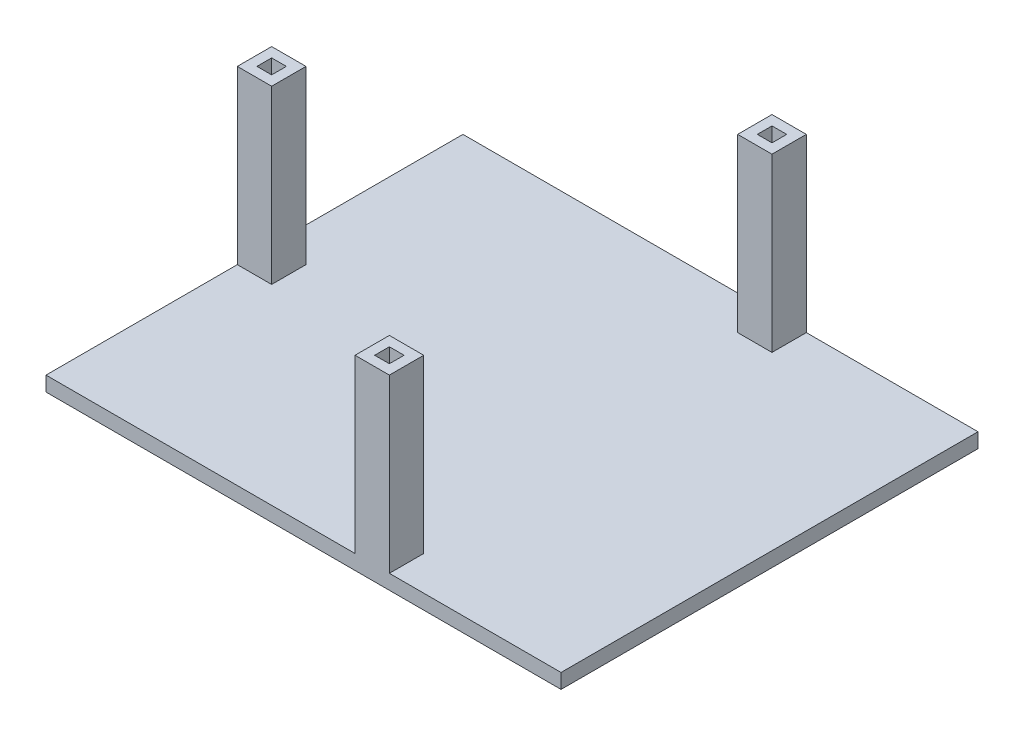
ISO-10303-21;
HEADER;
FILE_DESCRIPTION(('STEP AP214'),'2;1');
FILE_NAME('part.step','',(''),(''),'','','');
FILE_SCHEMA(('AUTOMOTIVE_DESIGN { 1 0 10303 214 1 1 1 1 }'));
ENDSEC;
DATA;
#1=APPLICATION_CONTEXT('core data for automotive mechanical design processes');
#2=APPLICATION_PROTOCOL_DEFINITION('international standard','automotive_design',2000,#1);
#3=PRODUCT_CONTEXT('',#1,'mechanical');
#4=PRODUCT('Part','Part','',(#3));
#5=PRODUCT_RELATED_PRODUCT_CATEGORY('part','',(#4));
#6=PRODUCT_DEFINITION_FORMATION('','',#4);
#7=PRODUCT_DEFINITION_CONTEXT('part definition',#1,'design');
#8=PRODUCT_DEFINITION('design','',#6,#7);
#9=PRODUCT_DEFINITION_SHAPE('','',#8);
#10=(LENGTH_UNIT() NAMED_UNIT(*) SI_UNIT(.MILLI.,.METRE.));
#11=(NAMED_UNIT(*) PLANE_ANGLE_UNIT() SI_UNIT($,.RADIAN.));
#12=(NAMED_UNIT(*) SI_UNIT($,.STERADIAN.) SOLID_ANGLE_UNIT());
#13=UNCERTAINTY_MEASURE_WITH_UNIT(LENGTH_MEASURE(1.E-05),#10,'distance_accuracy_value','');
#14=(GEOMETRIC_REPRESENTATION_CONTEXT(3) GLOBAL_UNCERTAINTY_ASSIGNED_CONTEXT((#13)) GLOBAL_UNIT_ASSIGNED_CONTEXT((#10,
#11,#12)) REPRESENTATION_CONTEXT('',''));
#15=CARTESIAN_POINT('',(0.,0.,0.));
#16=DIRECTION('',(0.,0.,1.));
#17=DIRECTION('',(1.,0.,0.));
#18=AXIS2_PLACEMENT_3D('',#15,#16,#17);
#19=CARTESIAN_POINT('',(0.,3.,0.));
#20=DIRECTION('',(0.,-1.,0.));
#21=DIRECTION('',(0.,0.,-1.));
#22=AXIS2_PLACEMENT_3D('',#19,#20,#21);
#23=PLANE('',#22);
#24=DIRECTION('',(0.,0.,1.));
#25=VECTOR('',#24,1.);
#26=CARTESIAN_POINT('',(-47.8168846611177,3.,0.));
#27=LINE('',#26,#25);
#28=CARTESIAN_POINT('',(-47.8168846611177,3.,19.3988109393579));
#29=VERTEX_POINT('',#28);
#30=CARTESIAN_POINT('',(-47.8168846611177,3.,26.3988109393579));
#31=VERTEX_POINT('',#30);
#32=EDGE_CURVE('E261',#29,#31,#27,.T.);
#33=ORIENTED_EDGE('',*,*,#32,.T.);
#34=DIRECTION('',(-1.,0.,0.));
#35=VECTOR('',#34,1.);
#36=CARTESIAN_POINT('',(0.,3.,26.3988109393579));
#37=LINE('',#36,#35);
#38=CARTESIAN_POINT('',(-54.8168846611177,3.,26.3988109393579));
#39=VERTEX_POINT('',#38);
#40=EDGE_CURVE('E224',#31,#39,#37,.T.);
#41=ORIENTED_EDGE('',*,*,#40,.T.);
#42=DIRECTION('',(0.,0.,-1.));
#43=VECTOR('',#42,1.);
#44=CARTESIAN_POINT('',(-54.8168846611177,3.,65.3988109393579));
#45=LINE('',#44,#43);
#46=CARTESIAN_POINT('',(-54.8168846611177,3.,65.3988109393579));
#47=VERTEX_POINT('',#46);
#48=EDGE_CURVE('E418',#47,#39,#45,.T.);
#49=ORIENTED_EDGE('',*,*,#48,.F.);
#50=DIRECTION('',(-1.,0.,0.));
#51=VECTOR('',#50,1.);
#52=CARTESIAN_POINT('',(50.1831153388823,3.,65.3988109393579));
#53=LINE('',#52,#51);
#54=CARTESIAN_POINT('',(8.18311533888228,3.,65.3988109393579));
#55=VERTEX_POINT('',#54);
#56=EDGE_CURVE('E417',#55,#47,#53,.T.);
#57=ORIENTED_EDGE('',*,*,#56,.F.);
#58=DIRECTION('',(0.,0.,1.));
#59=VECTOR('',#58,1.);
#60=CARTESIAN_POINT('',(8.18311533888228,3.,0.));
#61=LINE('',#60,#59);
#62=CARTESIAN_POINT('',(8.18311533888228,3.,58.3988109393579));
#63=VERTEX_POINT('',#62);
#64=EDGE_CURVE('E387',#63,#55,#61,.T.);
#65=ORIENTED_EDGE('',*,*,#64,.F.);
#66=DIRECTION('',(-1.,0.,0.));
#67=VECTOR('',#66,1.);
#68=CARTESIAN_POINT('',(0.,3.,58.3988109393579));
#69=LINE('',#68,#67);
#70=CARTESIAN_POINT('',(15.1831153388823,3.,58.3988109393579));
#71=VERTEX_POINT('',#70);
#72=EDGE_CURVE('E384',#71,#63,#69,.T.);
#73=ORIENTED_EDGE('',*,*,#72,.F.);
#74=DIRECTION('',(0.,0.,-1.));
#75=VECTOR('',#74,1.);
#76=CARTESIAN_POINT('',(15.1831153388823,3.,0.));
#77=LINE('',#76,#75);
#78=CARTESIAN_POINT('',(15.1831153388823,3.,65.3988109393579));
#79=VERTEX_POINT('',#78);
#80=EDGE_CURVE('E355',#79,#71,#77,.T.);
#81=ORIENTED_EDGE('',*,*,#80,.F.);
#82=CARTESIAN_POINT('',(50.1831153388823,3.,65.3988109393579));
#83=VERTEX_POINT('',#82);
#84=EDGE_CURVE('E413',#83,#79,#53,.T.);
#85=ORIENTED_EDGE('',*,*,#84,.F.);
#86=DIRECTION('',(0.,0.,1.));
#87=VECTOR('',#86,1.);
#88=CARTESIAN_POINT('',(50.1831153388823,3.,-19.6011890606421));
#89=LINE('',#88,#87);
#90=CARTESIAN_POINT('',(50.1831153388823,3.,-19.6011890606421));
#91=VERTEX_POINT('',#90);
#92=EDGE_CURVE('E425',#91,#83,#89,.T.);
#93=ORIENTED_EDGE('',*,*,#92,.F.);
#94=DIRECTION('',(1.,0.,0.));
#95=VECTOR('',#94,1.);
#96=CARTESIAN_POINT('',(-54.8168846611177,3.,-19.6011890606421));
#97=LINE('',#96,#95);
#98=CARTESIAN_POINT('',(15.1831153388823,3.,-19.6011890606421));
#99=VERTEX_POINT('',#98);
#100=EDGE_CURVE('E421',#99,#91,#97,.T.);
#101=ORIENTED_EDGE('',*,*,#100,.F.);
#102=DIRECTION('',(0.,0.,1.));
#103=VECTOR('',#102,1.);
#104=CARTESIAN_POINT('',(15.1831153388823,3.,0.));
#105=LINE('',#104,#103);
#106=CARTESIAN_POINT('',(15.1831153388823,3.,-12.6011890606421));
#107=VERTEX_POINT('',#106);
#108=EDGE_CURVE('E317',#99,#107,#105,.T.);
#109=ORIENTED_EDGE('',*,*,#108,.T.);
#110=DIRECTION('',(-1.,0.,0.));
#111=VECTOR('',#110,1.);
#112=CARTESIAN_POINT('',(0.,3.,-12.6011890606421));
#113=LINE('',#112,#111);
#114=CARTESIAN_POINT('',(8.18311533888227,3.,-12.6011890606421));
#115=VERTEX_POINT('',#114);
#116=EDGE_CURVE('E314',#107,#115,#113,.T.);
#117=ORIENTED_EDGE('',*,*,#116,.T.);
#118=DIRECTION('',(0.,0.,-1.));
#119=VECTOR('',#118,1.);
#120=CARTESIAN_POINT('',(8.18311533888226,3.,0.));
#121=LINE('',#120,#119);
#122=CARTESIAN_POINT('',(8.18311533888227,3.,-19.6011890606421));
#123=VERTEX_POINT('',#122);
#124=EDGE_CURVE('E283',#115,#123,#121,.T.);
#125=ORIENTED_EDGE('',*,*,#124,.T.);
#126=CARTESIAN_POINT('',(-54.8168846611177,3.,-19.6011890606421));
#127=VERTEX_POINT('',#126);
#128=EDGE_CURVE('E422',#127,#123,#97,.T.);
#129=ORIENTED_EDGE('',*,*,#128,.F.);
#130=CARTESIAN_POINT('',(-54.8168846611177,3.,19.3988109393579));
#131=VERTEX_POINT('',#130);
#132=EDGE_CURVE('E416',#131,#127,#45,.T.);
#133=ORIENTED_EDGE('',*,*,#132,.F.);
#134=DIRECTION('',(1.,0.,0.));
#135=VECTOR('',#134,1.);
#136=CARTESIAN_POINT('',(0.,3.,19.3988109393579));
#137=LINE('',#136,#135);
#138=EDGE_CURVE('E263',#131,#29,#137,.T.);
#139=ORIENTED_EDGE('',*,*,#138,.T.);
#140=EDGE_LOOP('',(#33,#41,#49,#57,#65,#73,#81,#85,#93,#101,#109,#117,#125,#129,#133,#139));
#141=FACE_BOUND('',#140,.T.);
#142=ADVANCED_FACE('F35',(#141),#23,.F.);
#143=CARTESIAN_POINT('',(50.1831153388823,3.,65.3988109393579));
#144=DIRECTION('',(0.,0.,1.));
#145=DIRECTION('',(1.,0.,0.));
#146=AXIS2_PLACEMENT_3D('',#143,#144,#145);
#147=PLANE('',#146);
#148=DIRECTION('',(-1.,0.,0.));
#149=VECTOR('',#148,1.);
#150=CARTESIAN_POINT('',(50.1831153388823,0.,65.3988109393579));
#151=LINE('',#150,#149);
#152=CARTESIAN_POINT('',(50.1831153388823,0.,65.3988109393579));
#153=VERTEX_POINT('',#152);
#154=CARTESIAN_POINT('',(-54.8168846611177,0.,65.3988109393579));
#155=VERTEX_POINT('',#154);
#156=EDGE_CURVE('E405',#153,#155,#151,.T.);
#157=ORIENTED_EDGE('',*,*,#156,.F.);
#158=DIRECTION('',(0.,-1.,0.));
#159=VECTOR('',#158,1.);
#160=CARTESIAN_POINT('',(50.1831153388823,3.,65.3988109393579));
#161=LINE('',#160,#159);
#162=EDGE_CURVE('E11',#83,#153,#161,.T.);
#163=ORIENTED_EDGE('',*,*,#162,.F.);
#164=ORIENTED_EDGE('',*,*,#84,.T.);
#165=DIRECTION('',(0.,-1.,0.));
#166=VECTOR('',#165,1.);
#167=CARTESIAN_POINT('',(15.1831153388823,38.,65.3988109393579));
#168=LINE('',#167,#166);
#169=CARTESIAN_POINT('',(15.1831153388823,38.,65.3988109393579));
#170=VERTEX_POINT('',#169);
#171=EDGE_CURVE('E395',#170,#79,#168,.T.);
#172=ORIENTED_EDGE('',*,*,#171,.F.);
#173=DIRECTION('',(1.,0.,0.));
#174=VECTOR('',#173,1.);
#175=CARTESIAN_POINT('',(0.,38.,65.3988109393579));
#176=LINE('',#175,#174);
#177=CARTESIAN_POINT('',(8.18311533888228,38.,65.3988109393579));
#178=VERTEX_POINT('',#177);
#179=EDGE_CURVE('E368',#178,#170,#176,.T.);
#180=ORIENTED_EDGE('',*,*,#179,.F.);
#181=DIRECTION('',(0.,-1.,0.));
#182=VECTOR('',#181,1.);
#183=CARTESIAN_POINT('',(8.18311533888228,38.,65.3988109393579));
#184=LINE('',#183,#182);
#185=EDGE_CURVE('E399',#178,#55,#184,.T.);
#186=ORIENTED_EDGE('',*,*,#185,.T.);
#187=ORIENTED_EDGE('',*,*,#56,.T.);
#188=DIRECTION('',(0.,-1.,0.));
#189=VECTOR('',#188,1.);
#190=CARTESIAN_POINT('',(-54.8168846611177,3.,65.3988109393579));
#191=LINE('',#190,#189);
#192=EDGE_CURVE('E39',#47,#155,#191,.T.);
#193=ORIENTED_EDGE('',*,*,#192,.T.);
#194=EDGE_LOOP('',(#157,#163,#164,#172,#180,#186,#187,#193));
#195=FACE_BOUND('',#194,.T.);
#196=ADVANCED_FACE('F37',(#195),#147,.T.);
#197=CARTESIAN_POINT('',(50.1831153388823,3.,-19.6011890606421));
#198=DIRECTION('',(1.,0.,0.));
#199=DIRECTION('',(0.,0.,-1.));
#200=AXIS2_PLACEMENT_3D('',#197,#198,#199);
#201=PLANE('',#200);
#202=DIRECTION('',(0.,0.,1.));
#203=VECTOR('',#202,1.);
#204=CARTESIAN_POINT('',(50.1831153388823,0.,-19.6011890606421));
#205=LINE('',#204,#203);
#206=CARTESIAN_POINT('',(50.1831153388823,0.,-19.6011890606421));
#207=VERTEX_POINT('',#206);
#208=EDGE_CURVE('E436',#207,#153,#205,.T.);
#209=ORIENTED_EDGE('',*,*,#208,.F.);
#210=DIRECTION('',(0.,-1.,0.));
#211=VECTOR('',#210,1.);
#212=CARTESIAN_POINT('',(50.1831153388823,3.,-19.6011890606421));
#213=LINE('',#212,#211);
#214=EDGE_CURVE('E44',#91,#207,#213,.T.);
#215=ORIENTED_EDGE('',*,*,#214,.F.);
#216=ORIENTED_EDGE('',*,*,#92,.T.);
#217=ORIENTED_EDGE('',*,*,#162,.T.);
#218=EDGE_LOOP('',(#209,#215,#216,#217));
#219=FACE_BOUND('',#218,.T.);
#220=ADVANCED_FACE('F454',(#219),#201,.T.);
#221=CARTESIAN_POINT('',(-54.8168846611177,3.,-19.6011890606421));
#222=DIRECTION('',(0.,0.,-1.));
#223=DIRECTION('',(-1.,0.,0.));
#224=AXIS2_PLACEMENT_3D('',#221,#222,#223);
#225=PLANE('',#224);
#226=DIRECTION('',(1.,0.,0.));
#227=VECTOR('',#226,1.);
#228=CARTESIAN_POINT('',(-54.8168846611177,0.,-19.6011890606421));
#229=LINE('',#228,#227);
#230=CARTESIAN_POINT('',(-54.8168846611177,0.,-19.6011890606421));
#231=VERTEX_POINT('',#230);
#232=EDGE_CURVE('E433',#231,#207,#229,.T.);
#233=ORIENTED_EDGE('',*,*,#232,.F.);
#234=DIRECTION('',(0.,-1.,0.));
#235=VECTOR('',#234,1.);
#236=CARTESIAN_POINT('',(-54.8168846611177,3.,-19.6011890606421));
#237=LINE('',#236,#235);
#238=EDGE_CURVE('E439',#127,#231,#237,.T.);
#239=ORIENTED_EDGE('',*,*,#238,.F.);
#240=ORIENTED_EDGE('',*,*,#128,.T.);
#241=DIRECTION('',(0.,-1.,0.));
#242=VECTOR('',#241,1.);
#243=CARTESIAN_POINT('',(8.18311533888227,38.,-19.6011890606421));
#244=LINE('',#243,#242);
#245=CARTESIAN_POINT('',(8.18311533888227,38.,-19.6011890606421));
#246=VERTEX_POINT('',#245);
#247=EDGE_CURVE('E311',#246,#123,#244,.T.);
#248=ORIENTED_EDGE('',*,*,#247,.F.);
#249=DIRECTION('',(-1.,0.,0.));
#250=VECTOR('',#249,1.);
#251=CARTESIAN_POINT('',(0.,38.,-19.6011890606421));
#252=LINE('',#251,#250);
#253=CARTESIAN_POINT('',(15.1831153388823,38.,-19.6011890606421));
#254=VERTEX_POINT('',#253);
#255=EDGE_CURVE('E299',#254,#246,#252,.T.);
#256=ORIENTED_EDGE('',*,*,#255,.F.);
#257=DIRECTION('',(0.,-1.,0.));
#258=VECTOR('',#257,1.);
#259=CARTESIAN_POINT('',(15.1831153388823,38.,-19.6011890606421));
#260=LINE('',#259,#258);
#261=EDGE_CURVE('E345',#254,#99,#260,.T.);
#262=ORIENTED_EDGE('',*,*,#261,.T.);
#263=ORIENTED_EDGE('',*,*,#100,.T.);
#264=ORIENTED_EDGE('',*,*,#214,.T.);
#265=EDGE_LOOP('',(#233,#239,#240,#248,#256,#262,#263,#264));
#266=FACE_BOUND('',#265,.T.);
#267=ADVANCED_FACE('F479',(#266),#225,.T.);
#268=CARTESIAN_POINT('',(-54.8168846611177,3.,65.3988109393579));
#269=DIRECTION('',(-1.,0.,0.));
#270=DIRECTION('',(0.,0.,1.));
#271=AXIS2_PLACEMENT_3D('',#268,#269,#270);
#272=PLANE('',#271);
#273=DIRECTION('',(0.,0.,-1.));
#274=VECTOR('',#273,1.);
#275=CARTESIAN_POINT('',(-54.8168846611177,0.,65.3988109393579));
#276=LINE('',#275,#274);
#277=EDGE_CURVE('E430',#155,#231,#276,.T.);
#278=ORIENTED_EDGE('',*,*,#277,.F.);
#279=ORIENTED_EDGE('',*,*,#192,.F.);
#280=ORIENTED_EDGE('',*,*,#48,.T.);
#281=DIRECTION('',(0.,-1.,0.));
#282=VECTOR('',#281,1.);
#283=CARTESIAN_POINT('',(-54.8168846611177,38.,26.3988109393579));
#284=LINE('',#283,#282);
#285=CARTESIAN_POINT('',(-54.8168846611177,38.,26.3988109393579));
#286=VERTEX_POINT('',#285);
#287=EDGE_CURVE('E259',#286,#39,#284,.T.);
#288=ORIENTED_EDGE('',*,*,#287,.F.);
#289=DIRECTION('',(0.,0.,1.));
#290=VECTOR('',#289,1.);
#291=CARTESIAN_POINT('',(-54.8168846611177,38.,0.));
#292=LINE('',#291,#290);
#293=CARTESIAN_POINT('',(-54.8168846611177,38.,19.3988109393579));
#294=VERTEX_POINT('',#293);
#295=EDGE_CURVE('E240',#294,#286,#292,.T.);
#296=ORIENTED_EDGE('',*,*,#295,.F.);
#297=DIRECTION('',(0.,-1.,0.));
#298=VECTOR('',#297,1.);
#299=CARTESIAN_POINT('',(-54.8168846611177,38.,19.3988109393579));
#300=LINE('',#299,#298);
#301=EDGE_CURVE('E285',#294,#131,#300,.T.);
#302=ORIENTED_EDGE('',*,*,#301,.T.);
#303=ORIENTED_EDGE('',*,*,#132,.T.);
#304=ORIENTED_EDGE('',*,*,#238,.T.);
#305=EDGE_LOOP('',(#278,#279,#280,#288,#296,#302,#303,#304));
#306=FACE_BOUND('',#305,.T.);
#307=ADVANCED_FACE('F448',(#306),#272,.T.);
#308=CARTESIAN_POINT('',(0.,0.,0.));
#309=DIRECTION('',(0.,-1.,0.));
#310=DIRECTION('',(0.,0.,-1.));
#311=AXIS2_PLACEMENT_3D('',#308,#309,#310);
#312=PLANE('',#311);
#313=ORIENTED_EDGE('',*,*,#156,.T.);
#314=ORIENTED_EDGE('',*,*,#277,.T.);
#315=ORIENTED_EDGE('',*,*,#232,.T.);
#316=ORIENTED_EDGE('',*,*,#208,.T.);
#317=EDGE_LOOP('',(#313,#314,#315,#316));
#318=FACE_BOUND('',#317,.T.);
#319=ADVANCED_FACE('F450',(#318),#312,.T.);
#320=CARTESIAN_POINT('',(0.,38.,58.3988109393579));
#321=DIRECTION('',(0.,0.,1.));
#322=DIRECTION('',(1.,0.,0.));
#323=AXIS2_PLACEMENT_3D('',#320,#321,#322);
#324=PLANE('',#323);
#325=ORIENTED_EDGE('',*,*,#72,.T.);
#326=DIRECTION('',(0.,-1.,0.));
#327=VECTOR('',#326,1.);
#328=CARTESIAN_POINT('',(8.18311533888228,38.,58.3988109393579));
#329=LINE('',#328,#327);
#330=CARTESIAN_POINT('',(8.18311533888228,38.,58.3988109393579));
#331=VERTEX_POINT('',#330);
#332=EDGE_CURVE('E402',#331,#63,#329,.T.);
#333=ORIENTED_EDGE('',*,*,#332,.F.);
#334=DIRECTION('',(-1.,0.,0.));
#335=VECTOR('',#334,1.);
#336=CARTESIAN_POINT('',(0.,38.,58.3988109393579));
#337=LINE('',#336,#335);
#338=CARTESIAN_POINT('',(15.1831153388823,38.,58.3988109393579));
#339=VERTEX_POINT('',#338);
#340=EDGE_CURVE('E363',#339,#331,#337,.T.);
#341=ORIENTED_EDGE('',*,*,#340,.F.);
#342=DIRECTION('',(0.,-1.,0.));
#343=VECTOR('',#342,1.);
#344=CARTESIAN_POINT('',(15.1831153388823,38.,58.3988109393579));
#345=LINE('',#344,#343);
#346=EDGE_CURVE('E392',#339,#71,#345,.T.);
#347=ORIENTED_EDGE('',*,*,#346,.T.);
#348=EDGE_LOOP('',(#325,#333,#341,#347));
#349=FACE_BOUND('',#348,.T.);
#350=ADVANCED_FACE('F466',(#349),#324,.F.);
#351=CARTESIAN_POINT('',(8.18311533888228,38.,0.));
#352=DIRECTION('',(1.,0.,0.));
#353=DIRECTION('',(0.,0.,-1.));
#354=AXIS2_PLACEMENT_3D('',#351,#352,#353);
#355=PLANE('',#354);
#356=ORIENTED_EDGE('',*,*,#64,.T.);
#357=ORIENTED_EDGE('',*,*,#185,.F.);
#358=DIRECTION('',(0.,0.,1.));
#359=VECTOR('',#358,1.);
#360=CARTESIAN_POINT('',(8.18311533888228,38.,0.));
#361=LINE('',#360,#359);
#362=EDGE_CURVE('E366',#331,#178,#361,.T.);
#363=ORIENTED_EDGE('',*,*,#362,.F.);
#364=ORIENTED_EDGE('',*,*,#332,.T.);
#365=EDGE_LOOP('',(#356,#357,#363,#364));
#366=FACE_BOUND('',#365,.T.);
#367=ADVANCED_FACE('F473',(#366),#355,.F.);
#368=CARTESIAN_POINT('',(0.,38.,63.3988109393579));
#369=DIRECTION('',(0.,0.,-1.));
#370=DIRECTION('',(-1.,0.,0.));
#371=AXIS2_PLACEMENT_3D('',#368,#369,#370);
#372=PLANE('',#371);
#373=DIRECTION('',(1.,0.,0.));
#374=VECTOR('',#373,1.);
#375=CARTESIAN_POINT('',(0.,3.,63.3988109393579));
#376=LINE('',#375,#374);
#377=CARTESIAN_POINT('',(10.1831153388823,3.,63.3988109393579));
#378=VERTEX_POINT('',#377);
#379=CARTESIAN_POINT('',(13.1831153388823,3.,63.3988109393579));
#380=VERTEX_POINT('',#379);
#381=EDGE_CURVE('E343',#378,#380,#376,.T.);
#382=ORIENTED_EDGE('',*,*,#381,.F.);
#383=DIRECTION('',(0.,-1.,0.));
#384=VECTOR('',#383,1.);
#385=CARTESIAN_POINT('',(10.1831153388823,38.,63.3988109393579));
#386=LINE('',#385,#384);
#387=CARTESIAN_POINT('',(10.1831153388823,38.,63.3988109393579));
#388=VERTEX_POINT('',#387);
#389=EDGE_CURVE('E396',#388,#378,#386,.T.);
#390=ORIENTED_EDGE('',*,*,#389,.F.);
#391=DIRECTION('',(1.,0.,0.));
#392=VECTOR('',#391,1.);
#393=CARTESIAN_POINT('',(0.,38.,63.3988109393579));
#394=LINE('',#393,#392);
#395=CARTESIAN_POINT('',(13.1831153388823,38.,63.3988109393579));
#396=VERTEX_POINT('',#395);
#397=EDGE_CURVE('E351',#388,#396,#394,.T.);
#398=ORIENTED_EDGE('',*,*,#397,.T.);
#399=DIRECTION('',(0.,-1.,0.));
#400=VECTOR('',#399,1.);
#401=CARTESIAN_POINT('',(13.1831153388823,38.,63.3988109393579));
#402=LINE('',#401,#400);
#403=EDGE_CURVE('E372',#396,#380,#402,.T.);
#404=ORIENTED_EDGE('',*,*,#403,.T.);
#405=EDGE_LOOP('',(#382,#390,#398,#404));
#406=FACE_BOUND('',#405,.T.);
#407=ADVANCED_FACE('F552',(#406),#372,.T.);
#408=CARTESIAN_POINT('',(10.1831153388823,38.,0.));
#409=DIRECTION('',(1.,0.,0.));
#410=DIRECTION('',(0.,0.,-1.));
#411=AXIS2_PLACEMENT_3D('',#408,#409,#410);
#412=PLANE('',#411);
#413=DIRECTION('',(0.,0.,1.));
#414=VECTOR('',#413,1.);
#415=CARTESIAN_POINT('',(10.1831153388823,3.,0.));
#416=LINE('',#415,#414);
#417=CARTESIAN_POINT('',(10.1831153388823,3.,60.3988109393579));
#418=VERTEX_POINT('',#417);
#419=EDGE_CURVE('E375',#418,#378,#416,.T.);
#420=ORIENTED_EDGE('',*,*,#419,.F.);
#421=DIRECTION('',(0.,-1.,0.));
#422=VECTOR('',#421,1.);
#423=CARTESIAN_POINT('',(10.1831153388823,38.,60.3988109393579));
#424=LINE('',#423,#422);
#425=CARTESIAN_POINT('',(10.1831153388823,38.,60.3988109393579));
#426=VERTEX_POINT('',#425);
#427=EDGE_CURVE('E409',#426,#418,#424,.T.);
#428=ORIENTED_EDGE('',*,*,#427,.F.);
#429=DIRECTION('',(0.,0.,1.));
#430=VECTOR('',#429,1.);
#431=CARTESIAN_POINT('',(10.1831153388823,38.,0.));
#432=LINE('',#431,#430);
#433=EDGE_CURVE('E354',#426,#388,#432,.T.);
#434=ORIENTED_EDGE('',*,*,#433,.T.);
#435=ORIENTED_EDGE('',*,*,#389,.T.);
#436=EDGE_LOOP('',(#420,#428,#434,#435));
#437=FACE_BOUND('',#436,.T.);
#438=ADVANCED_FACE('F548',(#437),#412,.T.);
#439=CARTESIAN_POINT('',(0.,38.,60.3988109393579));
#440=DIRECTION('',(0.,0.,1.));
#441=DIRECTION('',(1.,0.,0.));
#442=AXIS2_PLACEMENT_3D('',#439,#440,#441);
#443=PLANE('',#442);
#444=DIRECTION('',(-1.,0.,0.));
#445=VECTOR('',#444,1.);
#446=CARTESIAN_POINT('',(0.,3.,60.3988109393579));
#447=LINE('',#446,#445);
#448=CARTESIAN_POINT('',(13.1831153388823,3.,60.3988109393579));
#449=VERTEX_POINT('',#448);
#450=EDGE_CURVE('E378',#449,#418,#447,.T.);
#451=ORIENTED_EDGE('',*,*,#450,.F.);
#452=DIRECTION('',(0.,-1.,0.));
#453=VECTOR('',#452,1.);
#454=CARTESIAN_POINT('',(13.1831153388823,38.,60.3988109393579));
#455=LINE('',#454,#453);
#456=CARTESIAN_POINT('',(13.1831153388823,38.,60.3988109393579));
#457=VERTEX_POINT('',#456);
#458=EDGE_CURVE('E407',#457,#449,#455,.T.);
#459=ORIENTED_EDGE('',*,*,#458,.F.);
#460=DIRECTION('',(-1.,0.,0.));
#461=VECTOR('',#460,1.);
#462=CARTESIAN_POINT('',(0.,38.,60.3988109393579));
#463=LINE('',#462,#461);
#464=EDGE_CURVE('E358',#457,#426,#463,.T.);
#465=ORIENTED_EDGE('',*,*,#464,.T.);
#466=ORIENTED_EDGE('',*,*,#427,.T.);
#467=EDGE_LOOP('',(#451,#459,#465,#466));
#468=FACE_BOUND('',#467,.T.);
#469=ADVANCED_FACE('F559',(#468),#443,.T.);
#470=CARTESIAN_POINT('',(13.1831153388823,38.,0.));
#471=DIRECTION('',(1.,0.,0.));
#472=DIRECTION('',(0.,0.,-1.));
#473=AXIS2_PLACEMENT_3D('',#470,#471,#472);
#474=PLANE('',#473);
#475=DIRECTION('',(0.,0.,1.));
#476=VECTOR('',#475,1.);
#477=CARTESIAN_POINT('',(13.1831153388823,3.,0.));
#478=LINE('',#477,#476);
#479=EDGE_CURVE('E381',#449,#380,#478,.T.);
#480=ORIENTED_EDGE('',*,*,#479,.T.);
#481=ORIENTED_EDGE('',*,*,#403,.F.);
#482=DIRECTION('',(0.,0.,1.));
#483=VECTOR('',#482,1.);
#484=CARTESIAN_POINT('',(13.1831153388823,38.,0.));
#485=LINE('',#484,#483);
#486=EDGE_CURVE('E361',#457,#396,#485,.T.);
#487=ORIENTED_EDGE('',*,*,#486,.F.);
#488=ORIENTED_EDGE('',*,*,#458,.T.);
#489=EDGE_LOOP('',(#480,#481,#487,#488));
#490=FACE_BOUND('',#489,.T.);
#491=ADVANCED_FACE('F557',(#490),#474,.F.);
#492=CARTESIAN_POINT('',(15.1831153388823,38.,0.));
#493=DIRECTION('',(-1.,0.,0.));
#494=DIRECTION('',(0.,0.,1.));
#495=AXIS2_PLACEMENT_3D('',#492,#493,#494);
#496=PLANE('',#495);
#497=ORIENTED_EDGE('',*,*,#80,.T.);
#498=ORIENTED_EDGE('',*,*,#346,.F.);
#499=DIRECTION('',(0.,0.,-1.));
#500=VECTOR('',#499,1.);
#501=CARTESIAN_POINT('',(15.1831153388823,38.,0.));
#502=LINE('',#501,#500);
#503=EDGE_CURVE('E370',#170,#339,#502,.T.);
#504=ORIENTED_EDGE('',*,*,#503,.F.);
#505=ORIENTED_EDGE('',*,*,#171,.T.);
#506=EDGE_LOOP('',(#497,#498,#504,#505));
#507=FACE_BOUND('',#506,.T.);
#508=ADVANCED_FACE('F462',(#507),#496,.F.);
#509=CARTESIAN_POINT('',(0.,38.,0.));
#510=DIRECTION('',(0.,1.,0.));
#511=DIRECTION('',(0.,0.,1.));
#512=AXIS2_PLACEMENT_3D('',#509,#510,#511);
#513=PLANE('',#512);
#514=ORIENTED_EDGE('',*,*,#397,.F.);
#515=ORIENTED_EDGE('',*,*,#433,.F.);
#516=ORIENTED_EDGE('',*,*,#464,.F.);
#517=ORIENTED_EDGE('',*,*,#486,.T.);
#518=EDGE_LOOP('',(#514,#515,#516,#517));
#519=FACE_BOUND('',#518,.T.);
#520=ORIENTED_EDGE('',*,*,#340,.T.);
#521=ORIENTED_EDGE('',*,*,#362,.T.);
#522=ORIENTED_EDGE('',*,*,#179,.T.);
#523=ORIENTED_EDGE('',*,*,#503,.T.);
#524=EDGE_LOOP('',(#520,#521,#522,#523));
#525=FACE_BOUND('',#524,.T.);
#526=ADVANCED_FACE('F469',(#519,#525),#513,.T.);
#527=ORIENTED_EDGE('',*,*,#419,.T.);
#528=ORIENTED_EDGE('',*,*,#381,.T.);
#529=ORIENTED_EDGE('',*,*,#479,.F.);
#530=ORIENTED_EDGE('',*,*,#450,.T.);
#531=EDGE_LOOP('',(#527,#528,#529,#530));
#532=FACE_BOUND('',#531,.T.);
#533=ADVANCED_FACE('F525',(#532),#23,.F.);
#534=CARTESIAN_POINT('',(0.,38.,-14.6049678499764));
#535=DIRECTION('',(0.,0.,1.));
#536=DIRECTION('',(1.,0.,0.));
#537=AXIS2_PLACEMENT_3D('',#534,#535,#536);
#538=PLANE('',#537);
#539=DIRECTION('',(-1.,0.,0.));
#540=VECTOR('',#539,1.);
#541=CARTESIAN_POINT('',(0.,3.,-14.6049678499764));
#542=LINE('',#541,#540);
#543=CARTESIAN_POINT('',(13.1873248505485,3.,-14.6049678499764));
#544=VERTEX_POINT('',#543);
#545=CARTESIAN_POINT('',(10.1884296030903,3.,-14.6049678499764));
#546=VERTEX_POINT('',#545);
#547=EDGE_CURVE('E320',#544,#546,#542,.T.);
#548=ORIENTED_EDGE('',*,*,#547,.T.);
#549=DIRECTION('',(0.,-1.,0.));
#550=VECTOR('',#549,1.);
#551=CARTESIAN_POINT('',(10.1884296030903,38.,-14.6049678499764));
#552=LINE('',#551,#550);
#553=CARTESIAN_POINT('',(10.1884296030903,38.,-14.6049678499764));
#554=VERTEX_POINT('',#553);
#555=EDGE_CURVE('E340',#554,#546,#552,.T.);
#556=ORIENTED_EDGE('',*,*,#555,.F.);
#557=DIRECTION('',(-1.,0.,0.));
#558=VECTOR('',#557,1.);
#559=CARTESIAN_POINT('',(0.,38.,-14.6049678499764));
#560=LINE('',#559,#558);
#561=CARTESIAN_POINT('',(13.1873248505485,38.,-14.6049678499764));
#562=VERTEX_POINT('',#561);
#563=EDGE_CURVE('E301',#562,#554,#560,.T.);
#564=ORIENTED_EDGE('',*,*,#563,.F.);
#565=DIRECTION('',(0.,-1.,0.));
#566=VECTOR('',#565,1.);
#567=CARTESIAN_POINT('',(13.1873248505485,38.,-14.6049678499764));
#568=LINE('',#567,#566);
#569=EDGE_CURVE('E330',#562,#544,#568,.T.);
#570=ORIENTED_EDGE('',*,*,#569,.T.);
#571=EDGE_LOOP('',(#548,#556,#564,#570));
#572=FACE_BOUND('',#571,.T.);
#573=ADVANCED_FACE('F507',(#572),#538,.F.);
#574=CARTESIAN_POINT('',(10.1884296030903,38.,0.));
#575=DIRECTION('',(-1.,0.,0.));
#576=DIRECTION('',(0.,0.,1.));
#577=AXIS2_PLACEMENT_3D('',#574,#575,#576);
#578=PLANE('',#577);
#579=DIRECTION('',(0.,0.,-1.));
#580=VECTOR('',#579,1.);
#581=CARTESIAN_POINT('',(10.1884296030903,3.,0.));
#582=LINE('',#581,#580);
#583=CARTESIAN_POINT('',(10.1884296030903,3.,-17.6003484509408));
#584=VERTEX_POINT('',#583);
#585=EDGE_CURVE('E323',#546,#584,#582,.T.);
#586=ORIENTED_EDGE('',*,*,#585,.T.);
#587=DIRECTION('',(0.,-1.,0.));
#588=VECTOR('',#587,1.);
#589=CARTESIAN_POINT('',(10.1884296030903,38.,-17.6003484509408));
#590=LINE('',#589,#588);
#591=CARTESIAN_POINT('',(10.1884296030903,38.,-17.6003484509408));
#592=VERTEX_POINT('',#591);
#593=EDGE_CURVE('E337',#592,#584,#590,.T.);
#594=ORIENTED_EDGE('',*,*,#593,.F.);
#595=DIRECTION('',(0.,0.,-1.));
#596=VECTOR('',#595,1.);
#597=CARTESIAN_POINT('',(10.1884296030903,38.,0.));
#598=LINE('',#597,#596);
#599=EDGE_CURVE('E304',#554,#592,#598,.T.);
#600=ORIENTED_EDGE('',*,*,#599,.F.);
#601=ORIENTED_EDGE('',*,*,#555,.T.);
#602=EDGE_LOOP('',(#586,#594,#600,#601));
#603=FACE_BOUND('',#602,.T.);
#604=ADVANCED_FACE('F509',(#603),#578,.F.);
#605=CARTESIAN_POINT('',(0.,38.,-17.6003484509408));
#606=DIRECTION('',(0.,0.,1.));
#607=DIRECTION('',(1.,0.,0.));
#608=AXIS2_PLACEMENT_3D('',#605,#606,#607);
#609=PLANE('',#608);
#610=DIRECTION('',(-1.,0.,0.));
#611=VECTOR('',#610,1.);
#612=CARTESIAN_POINT('',(0.,3.,-17.6003484509408));
#613=LINE('',#612,#611);
#614=CARTESIAN_POINT('',(13.1873248505485,3.,-17.6003484509408));
#615=VERTEX_POINT('',#614);
#616=EDGE_CURVE('E326',#615,#584,#613,.T.);
#617=ORIENTED_EDGE('',*,*,#616,.F.);
#618=DIRECTION('',(0.,-1.,0.));
#619=VECTOR('',#618,1.);
#620=CARTESIAN_POINT('',(13.1873248505485,38.,-17.6003484509408));
#621=LINE('',#620,#619);
#622=CARTESIAN_POINT('',(13.1873248505485,38.,-17.6003484509408));
#623=VERTEX_POINT('',#622);
#624=EDGE_CURVE('E333',#623,#615,#621,.T.);
#625=ORIENTED_EDGE('',*,*,#624,.F.);
#626=DIRECTION('',(-1.,0.,0.));
#627=VECTOR('',#626,1.);
#628=CARTESIAN_POINT('',(0.,38.,-17.6003484509408));
#629=LINE('',#628,#627);
#630=EDGE_CURVE('E306',#623,#592,#629,.T.);
#631=ORIENTED_EDGE('',*,*,#630,.T.);
#632=ORIENTED_EDGE('',*,*,#593,.T.);
#633=EDGE_LOOP('',(#617,#625,#631,#632));
#634=FACE_BOUND('',#633,.T.);
#635=ADVANCED_FACE('F512',(#634),#609,.T.);
#636=CARTESIAN_POINT('',(8.18311533888226,38.,0.));
#637=DIRECTION('',(-1.,0.,0.));
#638=DIRECTION('',(0.,0.,1.));
#639=AXIS2_PLACEMENT_3D('',#636,#637,#638);
#640=PLANE('',#639);
#641=ORIENTED_EDGE('',*,*,#124,.F.);
#642=DIRECTION('',(0.,-1.,0.));
#643=VECTOR('',#642,1.);
#644=CARTESIAN_POINT('',(8.18311533888227,38.,-12.6011890606421));
#645=LINE('',#644,#643);
#646=CARTESIAN_POINT('',(8.18311533888227,38.,-12.6011890606421));
#647=VERTEX_POINT('',#646);
#648=EDGE_CURVE('E334',#647,#115,#645,.T.);
#649=ORIENTED_EDGE('',*,*,#648,.F.);
#650=DIRECTION('',(0.,0.,-1.));
#651=VECTOR('',#650,1.);
#652=CARTESIAN_POINT('',(8.18311533888226,38.,0.));
#653=LINE('',#652,#651);
#654=EDGE_CURVE('E289',#647,#246,#653,.T.);
#655=ORIENTED_EDGE('',*,*,#654,.T.);
#656=ORIENTED_EDGE('',*,*,#247,.T.);
#657=EDGE_LOOP('',(#641,#649,#655,#656));
#658=FACE_BOUND('',#657,.T.);
#659=ADVANCED_FACE('F492',(#658),#640,.T.);
#660=CARTESIAN_POINT('',(0.,38.,-12.6011890606421));
#661=DIRECTION('',(0.,0.,1.));
#662=DIRECTION('',(1.,0.,0.));
#663=AXIS2_PLACEMENT_3D('',#660,#661,#662);
#664=PLANE('',#663);
#665=ORIENTED_EDGE('',*,*,#116,.F.);
#666=DIRECTION('',(0.,-1.,0.));
#667=VECTOR('',#666,1.);
#668=CARTESIAN_POINT('',(15.1831153388823,38.,-12.6011890606421));
#669=LINE('',#668,#667);
#670=CARTESIAN_POINT('',(15.1831153388823,38.,-12.6011890606421));
#671=VERTEX_POINT('',#670);
#672=EDGE_CURVE('E348',#671,#107,#669,.T.);
#673=ORIENTED_EDGE('',*,*,#672,.F.);
#674=DIRECTION('',(-1.,0.,0.));
#675=VECTOR('',#674,1.);
#676=CARTESIAN_POINT('',(0.,38.,-12.6011890606421));
#677=LINE('',#676,#675);
#678=EDGE_CURVE('E292',#671,#647,#677,.T.);
#679=ORIENTED_EDGE('',*,*,#678,.T.);
#680=ORIENTED_EDGE('',*,*,#648,.T.);
#681=EDGE_LOOP('',(#665,#673,#679,#680));
#682=FACE_BOUND('',#681,.T.);
#683=ADVANCED_FACE('F488',(#682),#664,.T.);
#684=CARTESIAN_POINT('',(15.1831153388823,38.,0.));
#685=DIRECTION('',(1.,0.,0.));
#686=DIRECTION('',(0.,0.,-1.));
#687=AXIS2_PLACEMENT_3D('',#684,#685,#686);
#688=PLANE('',#687);
#689=ORIENTED_EDGE('',*,*,#108,.F.);
#690=ORIENTED_EDGE('',*,*,#261,.F.);
#691=DIRECTION('',(0.,0.,1.));
#692=VECTOR('',#691,1.);
#693=CARTESIAN_POINT('',(15.1831153388823,38.,0.));
#694=LINE('',#693,#692);
#695=EDGE_CURVE('E296',#254,#671,#694,.T.);
#696=ORIENTED_EDGE('',*,*,#695,.T.);
#697=ORIENTED_EDGE('',*,*,#672,.T.);
#698=EDGE_LOOP('',(#689,#690,#696,#697));
#699=FACE_BOUND('',#698,.T.);
#700=ADVANCED_FACE('F484',(#699),#688,.T.);
#701=CARTESIAN_POINT('',(13.1873248505485,38.,0.));
#702=DIRECTION('',(1.,0.,0.));
#703=DIRECTION('',(0.,0.,-1.));
#704=AXIS2_PLACEMENT_3D('',#701,#702,#703);
#705=PLANE('',#704);
#706=DIRECTION('',(0.,0.,1.));
#707=VECTOR('',#706,1.);
#708=CARTESIAN_POINT('',(13.1873248505485,3.,0.));
#709=LINE('',#708,#707);
#710=EDGE_CURVE('E293',#615,#544,#709,.T.);
#711=ORIENTED_EDGE('',*,*,#710,.T.);
#712=ORIENTED_EDGE('',*,*,#569,.F.);
#713=DIRECTION('',(0.,0.,1.));
#714=VECTOR('',#713,1.);
#715=CARTESIAN_POINT('',(13.1873248505485,38.,0.));
#716=LINE('',#715,#714);
#717=EDGE_CURVE('E309',#623,#562,#716,.T.);
#718=ORIENTED_EDGE('',*,*,#717,.F.);
#719=ORIENTED_EDGE('',*,*,#624,.T.);
#720=EDGE_LOOP('',(#711,#712,#718,#719));
#721=FACE_BOUND('',#720,.T.);
#722=ADVANCED_FACE('F498',(#721),#705,.F.);
#723=CARTESIAN_POINT('',(0.,38.,0.));
#724=DIRECTION('',(0.,1.,0.));
#725=DIRECTION('',(0.,0.,1.));
#726=AXIS2_PLACEMENT_3D('',#723,#724,#725);
#727=PLANE('',#726);
#728=ORIENTED_EDGE('',*,*,#654,.F.);
#729=ORIENTED_EDGE('',*,*,#678,.F.);
#730=ORIENTED_EDGE('',*,*,#695,.F.);
#731=ORIENTED_EDGE('',*,*,#255,.T.);
#732=EDGE_LOOP('',(#728,#729,#730,#731));
#733=FACE_BOUND('',#732,.T.);
#734=ORIENTED_EDGE('',*,*,#563,.T.);
#735=ORIENTED_EDGE('',*,*,#599,.T.);
#736=ORIENTED_EDGE('',*,*,#630,.F.);
#737=ORIENTED_EDGE('',*,*,#717,.T.);
#738=EDGE_LOOP('',(#734,#735,#736,#737));
#739=FACE_BOUND('',#738,.T.);
#740=ADVANCED_FACE('F494',(#733,#739),#727,.T.);
#741=ORIENTED_EDGE('',*,*,#547,.F.);
#742=ORIENTED_EDGE('',*,*,#710,.F.);
#743=ORIENTED_EDGE('',*,*,#616,.T.);
#744=ORIENTED_EDGE('',*,*,#585,.F.);
#745=EDGE_LOOP('',(#741,#742,#743,#744));
#746=FACE_BOUND('',#745,.T.);
#747=ADVANCED_FACE('F497',(#746),#23,.F.);
#748=CARTESIAN_POINT('',(-52.8168846611177,38.,0.));
#749=DIRECTION('',(-1.,0.,0.));
#750=DIRECTION('',(0.,0.,1.));
#751=AXIS2_PLACEMENT_3D('',#748,#749,#750);
#752=PLANE('',#751);
#753=DIRECTION('',(0.,0.,-1.));
#754=VECTOR('',#753,1.);
#755=CARTESIAN_POINT('',(-52.8168846611177,3.,0.));
#756=LINE('',#755,#754);
#757=CARTESIAN_POINT('',(-52.8168846611177,3.,24.3988109393579));
#758=VERTEX_POINT('',#757);
#759=CARTESIAN_POINT('',(-52.8168846611177,3.,21.3988109393579));
#760=VERTEX_POINT('',#759);
#761=EDGE_CURVE('E266',#758,#760,#756,.T.);
#762=ORIENTED_EDGE('',*,*,#761,.T.);
#763=DIRECTION('',(0.,-1.,0.));
#764=VECTOR('',#763,1.);
#765=CARTESIAN_POINT('',(-52.8168846611177,38.,21.3988109393579));
#766=LINE('',#765,#764);
#767=CARTESIAN_POINT('',(-52.8168846611177,38.,21.3988109393579));
#768=VERTEX_POINT('',#767);
#769=EDGE_CURVE('E281',#768,#760,#766,.T.);
#770=ORIENTED_EDGE('',*,*,#769,.F.);
#771=DIRECTION('',(0.,0.,-1.));
#772=VECTOR('',#771,1.);
#773=CARTESIAN_POINT('',(-52.8168846611177,38.,0.));
#774=LINE('',#773,#772);
#775=CARTESIAN_POINT('',(-52.8168846611177,38.,24.3988109393579));
#776=VERTEX_POINT('',#775);
#777=EDGE_CURVE('E250',#776,#768,#774,.T.);
#778=ORIENTED_EDGE('',*,*,#777,.F.);
#779=DIRECTION('',(0.,-1.,0.));
#780=VECTOR('',#779,1.);
#781=CARTESIAN_POINT('',(-52.8168846611177,38.,24.3988109393579));
#782=LINE('',#781,#780);
#783=EDGE_CURVE('E229',#776,#758,#782,.T.);
#784=ORIENTED_EDGE('',*,*,#783,.T.);
#785=EDGE_LOOP('',(#762,#770,#778,#784));
#786=FACE_BOUND('',#785,.T.);
#787=ADVANCED_FACE('F516',(#786),#752,.F.);
#788=CARTESIAN_POINT('',(0.,38.,21.3988109393579));
#789=DIRECTION('',(0.,0.,-1.));
#790=DIRECTION('',(-1.,0.,0.));
#791=AXIS2_PLACEMENT_3D('',#788,#789,#790);
#792=PLANE('',#791);
#793=DIRECTION('',(1.,0.,0.));
#794=VECTOR('',#793,1.);
#795=CARTESIAN_POINT('',(0.,3.,21.3988109393579));
#796=LINE('',#795,#794);
#797=CARTESIAN_POINT('',(-49.8168846611177,3.,21.3988109393579));
#798=VERTEX_POINT('',#797);
#799=EDGE_CURVE('E52',#760,#798,#796,.T.);
#800=ORIENTED_EDGE('',*,*,#799,.T.);
#801=DIRECTION('',(0.,-1.,0.));
#802=VECTOR('',#801,1.);
#803=CARTESIAN_POINT('',(-49.8168846611177,38.,21.3988109393579));
#804=LINE('',#803,#802);
#805=CARTESIAN_POINT('',(-49.8168846611177,38.,21.3988109393579));
#806=VERTEX_POINT('',#805);
#807=EDGE_CURVE('E278',#806,#798,#804,.T.);
#808=ORIENTED_EDGE('',*,*,#807,.F.);
#809=DIRECTION('',(1.,0.,0.));
#810=VECTOR('',#809,1.);
#811=CARTESIAN_POINT('',(0.,38.,21.3988109393579));
#812=LINE('',#811,#810);
#813=EDGE_CURVE('E253',#768,#806,#812,.T.);
#814=ORIENTED_EDGE('',*,*,#813,.F.);
#815=ORIENTED_EDGE('',*,*,#769,.T.);
#816=EDGE_LOOP('',(#800,#808,#814,#815));
#817=FACE_BOUND('',#816,.T.);
#818=ADVANCED_FACE('F522',(#817),#792,.F.);
#819=CARTESIAN_POINT('',(-49.8168846611177,38.,0.));
#820=DIRECTION('',(1.,0.,0.));
#821=DIRECTION('',(0.,0.,-1.));
#822=AXIS2_PLACEMENT_3D('',#819,#820,#821);
#823=PLANE('',#822);
#824=DIRECTION('',(0.,0.,1.));
#825=VECTOR('',#824,1.);
#826=CARTESIAN_POINT('',(-49.8168846611177,3.,0.));
#827=LINE('',#826,#825);
#828=CARTESIAN_POINT('',(-49.8168846611177,3.,24.3988109393579));
#829=VERTEX_POINT('',#828);
#830=EDGE_CURVE('E57',#798,#829,#827,.T.);
#831=ORIENTED_EDGE('',*,*,#830,.T.);
#832=DIRECTION('',(0.,-1.,0.));
#833=VECTOR('',#832,1.);
#834=CARTESIAN_POINT('',(-49.8168846611177,38.,24.3988109393579));
#835=LINE('',#834,#833);
#836=CARTESIAN_POINT('',(-49.8168846611177,38.,24.3988109393579));
#837=VERTEX_POINT('',#836);
#838=EDGE_CURVE('E275',#837,#829,#835,.T.);
#839=ORIENTED_EDGE('',*,*,#838,.F.);
#840=DIRECTION('',(0.,0.,1.));
#841=VECTOR('',#840,1.);
#842=CARTESIAN_POINT('',(-49.8168846611177,38.,0.));
#843=LINE('',#842,#841);
#844=EDGE_CURVE('E255',#806,#837,#843,.T.);
#845=ORIENTED_EDGE('',*,*,#844,.F.);
#846=ORIENTED_EDGE('',*,*,#807,.T.);
#847=EDGE_LOOP('',(#831,#839,#845,#846));
#848=FACE_BOUND('',#847,.T.);
#849=ADVANCED_FACE('F594',(#848),#823,.F.);
#850=CARTESIAN_POINT('',(0.,38.,26.3988109393579));
#851=DIRECTION('',(0.,0.,1.));
#852=DIRECTION('',(1.,0.,0.));
#853=AXIS2_PLACEMENT_3D('',#850,#851,#852);
#854=PLANE('',#853);
#855=ORIENTED_EDGE('',*,*,#40,.F.);
#856=DIRECTION('',(0.,-1.,0.));
#857=VECTOR('',#856,1.);
#858=CARTESIAN_POINT('',(-47.8168846611177,38.,26.3988109393579));
#859=LINE('',#858,#857);
#860=CARTESIAN_POINT('',(-47.8168846611177,38.,26.3988109393579));
#861=VERTEX_POINT('',#860);
#862=EDGE_CURVE('E219',#861,#31,#859,.T.);
#863=ORIENTED_EDGE('',*,*,#862,.F.);
#864=DIRECTION('',(-1.,0.,0.));
#865=VECTOR('',#864,1.);
#866=CARTESIAN_POINT('',(0.,38.,26.3988109393579));
#867=LINE('',#866,#865);
#868=EDGE_CURVE('E222',#861,#286,#867,.T.);
#869=ORIENTED_EDGE('',*,*,#868,.T.);
#870=ORIENTED_EDGE('',*,*,#287,.T.);
#871=EDGE_LOOP('',(#855,#863,#869,#870));
#872=FACE_BOUND('',#871,.T.);
#873=ADVANCED_FACE('F221',(#872),#854,.T.);
#874=CARTESIAN_POINT('',(-47.8168846611177,38.,0.));
#875=DIRECTION('',(1.,0.,0.));
#876=DIRECTION('',(0.,0.,-1.));
#877=AXIS2_PLACEMENT_3D('',#874,#875,#876);
#878=PLANE('',#877);
#879=ORIENTED_EDGE('',*,*,#32,.F.);
#880=DIRECTION('',(0.,-1.,0.));
#881=VECTOR('',#880,1.);
#882=CARTESIAN_POINT('',(-47.8168846611177,38.,19.3988109393579));
#883=LINE('',#882,#881);
#884=CARTESIAN_POINT('',(-47.8168846611177,38.,19.3988109393579));
#885=VERTEX_POINT('',#884);
#886=EDGE_CURVE('E230',#885,#29,#883,.T.);
#887=ORIENTED_EDGE('',*,*,#886,.F.);
#888=DIRECTION('',(0.,0.,1.));
#889=VECTOR('',#888,1.);
#890=CARTESIAN_POINT('',(-47.8168846611177,38.,0.));
#891=LINE('',#890,#889);
#892=EDGE_CURVE('E237',#885,#861,#891,.T.);
#893=ORIENTED_EDGE('',*,*,#892,.T.);
#894=ORIENTED_EDGE('',*,*,#862,.T.);
#895=EDGE_LOOP('',(#879,#887,#893,#894));
#896=FACE_BOUND('',#895,.T.);
#897=ADVANCED_FACE('F244',(#896),#878,.T.);
#898=CARTESIAN_POINT('',(0.,38.,19.3988109393579));
#899=DIRECTION('',(0.,0.,-1.));
#900=DIRECTION('',(-1.,0.,0.));
#901=AXIS2_PLACEMENT_3D('',#898,#899,#900);
#902=PLANE('',#901);
#903=ORIENTED_EDGE('',*,*,#138,.F.);
#904=ORIENTED_EDGE('',*,*,#301,.F.);
#905=DIRECTION('',(1.,0.,0.));
#906=VECTOR('',#905,1.);
#907=CARTESIAN_POINT('',(0.,38.,19.3988109393579));
#908=LINE('',#907,#906);
#909=EDGE_CURVE('E245',#294,#885,#908,.T.);
#910=ORIENTED_EDGE('',*,*,#909,.T.);
#911=ORIENTED_EDGE('',*,*,#886,.T.);
#912=EDGE_LOOP('',(#903,#904,#910,#911));
#913=FACE_BOUND('',#912,.T.);
#914=ADVANCED_FACE('F476',(#913),#902,.T.);
#915=CARTESIAN_POINT('',(0.,38.,24.3988109393579));
#916=DIRECTION('',(0.,0.,1.));
#917=DIRECTION('',(1.,0.,0.));
#918=AXIS2_PLACEMENT_3D('',#915,#916,#917);
#919=PLANE('',#918);
#920=DIRECTION('',(-1.,0.,0.));
#921=VECTOR('',#920,1.);
#922=CARTESIAN_POINT('',(0.,3.,24.3988109393579));
#923=LINE('',#922,#921);
#924=EDGE_CURVE('E242',#829,#758,#923,.T.);
#925=ORIENTED_EDGE('',*,*,#924,.T.);
#926=ORIENTED_EDGE('',*,*,#783,.F.);
#927=DIRECTION('',(-1.,0.,0.));
#928=VECTOR('',#927,1.);
#929=CARTESIAN_POINT('',(0.,38.,24.3988109393579));
#930=LINE('',#929,#928);
#931=EDGE_CURVE('E257',#837,#776,#930,.T.);
#932=ORIENTED_EDGE('',*,*,#931,.F.);
#933=ORIENTED_EDGE('',*,*,#838,.T.);
#934=EDGE_LOOP('',(#925,#926,#932,#933));
#935=FACE_BOUND('',#934,.T.);
#936=ADVANCED_FACE('F533',(#935),#919,.F.);
#937=CARTESIAN_POINT('',(0.,38.,0.));
#938=DIRECTION('',(0.,1.,0.));
#939=DIRECTION('',(0.,0.,1.));
#940=AXIS2_PLACEMENT_3D('',#937,#938,#939);
#941=PLANE('',#940);
#942=ORIENTED_EDGE('',*,*,#868,.F.);
#943=ORIENTED_EDGE('',*,*,#892,.F.);
#944=ORIENTED_EDGE('',*,*,#909,.F.);
#945=ORIENTED_EDGE('',*,*,#295,.T.);
#946=EDGE_LOOP('',(#942,#943,#944,#945));
#947=FACE_BOUND('',#946,.T.);
#948=ORIENTED_EDGE('',*,*,#777,.T.);
#949=ORIENTED_EDGE('',*,*,#813,.T.);
#950=ORIENTED_EDGE('',*,*,#844,.T.);
#951=ORIENTED_EDGE('',*,*,#931,.T.);
#952=EDGE_LOOP('',(#948,#949,#950,#951));
#953=FACE_BOUND('',#952,.T.);
#954=ADVANCED_FACE('F234',(#947,#953),#941,.T.);
#955=ORIENTED_EDGE('',*,*,#761,.F.);
#956=ORIENTED_EDGE('',*,*,#924,.F.);
#957=ORIENTED_EDGE('',*,*,#830,.F.);
#958=ORIENTED_EDGE('',*,*,#799,.F.);
#959=EDGE_LOOP('',(#955,#956,#957,#958));
#960=FACE_BOUND('',#959,.T.);
#961=ADVANCED_FACE('F518',(#960),#23,.F.);
#962=CLOSED_SHELL('',(#142,#196,#220,#267,#307,#319,#350,#367,#407,#438,#469,#491,#508,#526,
#533,#573,#604,#635,#659,#683,#700,#722,#740,#747,#787,#818,#849,#873,#897,#914,#936,#954,#961));
#963=MANIFOLD_SOLID_BREP('B2',#962);
#964=ADVANCED_BREP_SHAPE_REPRESENTATION('',(#18,#963),#14);
#965=SHAPE_DEFINITION_REPRESENTATION(#9,#964);
ENDSEC;
END-ISO-10303-21;
